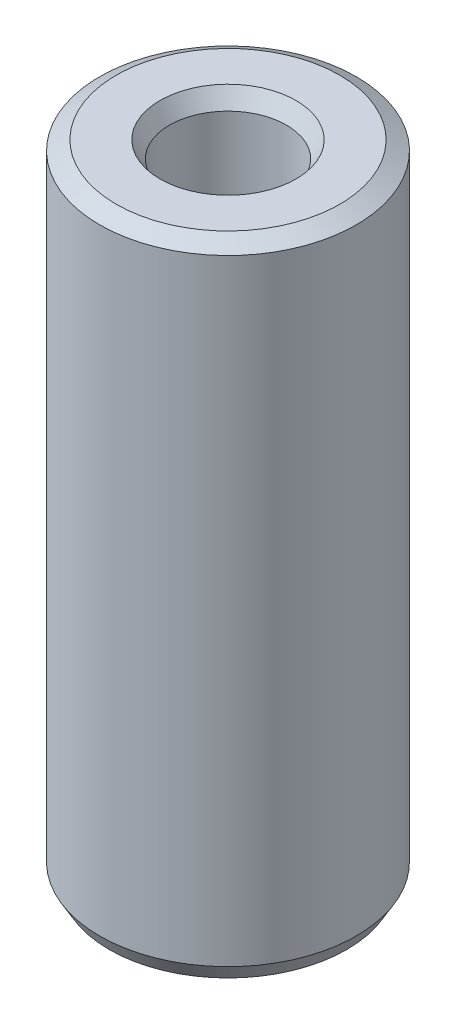
ISO-10303-21;
HEADER;
FILE_DESCRIPTION(('STEP AP214'),'2;1');
FILE_NAME('part.step','',(''),(''),'','','');
FILE_SCHEMA(('AUTOMOTIVE_DESIGN { 1 0 10303 214 1 1 1 1 }'));
ENDSEC;
DATA;
#1=APPLICATION_CONTEXT('core data for automotive mechanical design processes');
#2=APPLICATION_PROTOCOL_DEFINITION('international standard','automotive_design',2000,#1);
#3=PRODUCT_CONTEXT('',#1,'mechanical');
#4=PRODUCT('Part','Part','',(#3));
#5=PRODUCT_RELATED_PRODUCT_CATEGORY('part','',(#4));
#6=PRODUCT_DEFINITION_FORMATION('','',#4);
#7=PRODUCT_DEFINITION_CONTEXT('part definition',#1,'design');
#8=PRODUCT_DEFINITION('design','',#6,#7);
#9=PRODUCT_DEFINITION_SHAPE('','',#8);
#10=(LENGTH_UNIT() NAMED_UNIT(*) SI_UNIT(.MILLI.,.METRE.));
#11=(NAMED_UNIT(*) PLANE_ANGLE_UNIT() SI_UNIT($,.RADIAN.));
#12=(NAMED_UNIT(*) SI_UNIT($,.STERADIAN.) SOLID_ANGLE_UNIT());
#13=UNCERTAINTY_MEASURE_WITH_UNIT(LENGTH_MEASURE(1.E-05),#10,'distance_accuracy_value','');
#14=(GEOMETRIC_REPRESENTATION_CONTEXT(3) GLOBAL_UNCERTAINTY_ASSIGNED_CONTEXT((#13)) GLOBAL_UNIT_ASSIGNED_CONTEXT((#10,
#11,#12)) REPRESENTATION_CONTEXT('',''));
#15=CARTESIAN_POINT('',(0.,0.,0.));
#16=DIRECTION('',(0.,0.,1.));
#17=DIRECTION('',(1.,0.,0.));
#18=AXIS2_PLACEMENT_3D('',#15,#16,#17);
#19=CARTESIAN_POINT('',(0.,150.065307436167,0.));
#20=DIRECTION('',(0.,-1.,0.));
#21=DIRECTION('',(0.,0.,-1.));
#22=AXIS2_PLACEMENT_3D('',#19,#20,#21);
#23=CYLINDRICAL_SURFACE('',#22,30.);
#24=CARTESIAN_POINT('',(0.,3.86641381669273,0.));
#25=DIRECTION('',(0.,1.,0.));
#26=DIRECTION('',(0.,0.,1.));
#27=AXIS2_PLACEMENT_3D('',#24,#25,#26);
#28=CIRCLE('',#27,30.);
#29=CARTESIAN_POINT('',(0.,3.86641381669273,30.));
#30=VERTEX_POINT('',#29);
#31=EDGE_CURVE('E10',#30,#30,#28,.T.);
#32=ORIENTED_EDGE('',*,*,#31,.T.);
#33=EDGE_LOOP('',(#32));
#34=FACE_BOUND('',#33,.T.);
#35=CARTESIAN_POINT('',(0.,147.833032378301,0.));
#36=DIRECTION('',(0.,1.,0.));
#37=DIRECTION('',(0.,0.,1.));
#38=AXIS2_PLACEMENT_3D('',#35,#36,#37);
#39=CIRCLE('',#38,30.);
#40=CARTESIAN_POINT('',(0.,147.833032378301,30.));
#41=VERTEX_POINT('',#40);
#42=EDGE_CURVE('E50',#41,#41,#39,.F.);
#43=ORIENTED_EDGE('',*,*,#42,.T.);
#44=EDGE_LOOP('',(#43));
#45=FACE_BOUND('',#44,.T.);
#46=ADVANCED_FACE('F39',(#34,#45),#23,.T.);
#47=CARTESIAN_POINT('',(0.,150.065307436167,0.));
#48=DIRECTION('',(0.,1.,0.));
#49=DIRECTION('',(0.,0.,1.));
#50=AXIS2_PLACEMENT_3D('',#47,#48,#49);
#51=PLANE('',#50);
#52=CARTESIAN_POINT('',(0.,150.065307436167,0.));
#53=DIRECTION('',(0.,1.,0.));
#54=DIRECTION('',(0.,0.,1.));
#55=AXIS2_PLACEMENT_3D('',#52,#53,#54);
#56=CIRCLE('',#55,15.9015084205418);
#57=CARTESIAN_POINT('',(0.,150.065307436167,15.9015084205418));
#58=VERTEX_POINT('',#57);
#59=EDGE_CURVE('E58',#58,#58,#56,.F.);
#60=ORIENTED_EDGE('',*,*,#59,.T.);
#61=EDGE_LOOP('',(#60));
#62=FACE_BOUND('',#61,.T.);
#63=CARTESIAN_POINT('',(0.,150.065307436167,0.));
#64=DIRECTION('',(0.,1.,0.));
#65=DIRECTION('',(0.,0.,1.));
#66=AXIS2_PLACEMENT_3D('',#63,#64,#65);
#67=CIRCLE('',#66,26.1335861833073);
#68=CARTESIAN_POINT('',(0.,150.065307436167,26.1335861833073));
#69=VERTEX_POINT('',#68);
#70=EDGE_CURVE('E61',#69,#69,#67,.T.);
#71=ORIENTED_EDGE('',*,*,#70,.T.);
#72=EDGE_LOOP('',(#71));
#73=FACE_BOUND('',#72,.T.);
#74=ADVANCED_FACE('F88',(#62,#73),#51,.T.);
#75=CARTESIAN_POINT('',(0.,0.,0.));
#76=DIRECTION('',(0.,1.,0.));
#77=DIRECTION('',(0.,0.,1.));
#78=AXIS2_PLACEMENT_3D('',#75,#76,#77);
#79=PLANE('',#78);
#80=CARTESIAN_POINT('',(0.,0.,0.));
#81=DIRECTION('',(0.,1.,0.));
#82=DIRECTION('',(0.,0.,1.));
#83=AXIS2_PLACEMENT_3D('',#80,#81,#82);
#84=CIRCLE('',#83,17.5356471793684);
#85=CARTESIAN_POINT('',(0.,0.,17.5356471793684));
#86=VERTEX_POINT('',#85);
#87=EDGE_CURVE('E51',#86,#86,#84,.T.);
#88=ORIENTED_EDGE('',*,*,#87,.T.);
#89=EDGE_LOOP('',(#88));
#90=FACE_BOUND('',#89,.T.);
#91=CARTESIAN_POINT('',(0.,0.,0.));
#92=DIRECTION('',(0.,1.,0.));
#93=DIRECTION('',(0.,0.,1.));
#94=AXIS2_PLACEMENT_3D('',#91,#92,#93);
#95=CIRCLE('',#94,27.7677249421339);
#96=CARTESIAN_POINT('',(0.,0.,27.7677249421339));
#97=VERTEX_POINT('',#96);
#98=EDGE_CURVE('E54',#97,#97,#95,.F.);
#99=ORIENTED_EDGE('',*,*,#98,.T.);
#100=EDGE_LOOP('',(#99));
#101=FACE_BOUND('',#100,.T.);
#102=ADVANCED_FACE('F83',(#90,#101),#79,.F.);
#103=CARTESIAN_POINT('',(0.,150.065307436167,0.));
#104=DIRECTION('',(0.,-1.,0.));
#105=DIRECTION('',(0.,0.,-1.));
#106=AXIS2_PLACEMENT_3D('',#103,#104,#105);
#107=CYLINDRICAL_SURFACE('',#106,13.6692333626757);
#108=CARTESIAN_POINT('',(0.,146.198893619474,0.));
#109=DIRECTION('',(0.,1.,0.));
#110=DIRECTION('',(0.,0.,1.));
#111=AXIS2_PLACEMENT_3D('',#108,#109,#110);
#112=CIRCLE('',#111,13.6692333626757);
#113=CARTESIAN_POINT('',(0.,146.198893619474,13.6692333626757));
#114=VERTEX_POINT('',#113);
#115=EDGE_CURVE('E67',#114,#114,#112,.T.);
#116=ORIENTED_EDGE('',*,*,#115,.T.);
#117=EDGE_LOOP('',(#116));
#118=FACE_BOUND('',#117,.T.);
#119=CARTESIAN_POINT('',(0.,2.23227505786605,0.));
#120=DIRECTION('',(0.,1.,0.));
#121=DIRECTION('',(0.,0.,1.));
#122=AXIS2_PLACEMENT_3D('',#119,#120,#121);
#123=CIRCLE('',#122,13.6692333626757);
#124=CARTESIAN_POINT('',(0.,2.23227505786605,13.6692333626757));
#125=VERTEX_POINT('',#124);
#126=EDGE_CURVE('E69',#125,#125,#123,.F.);
#127=ORIENTED_EDGE('',*,*,#126,.T.);
#128=EDGE_LOOP('',(#127));
#129=FACE_BOUND('',#128,.T.);
#130=ADVANCED_FACE('F71',(#118,#129),#107,.F.);
#131=CARTESIAN_POINT('',(0.,146.198893619474,0.));
#132=DIRECTION('',(0.,1.,0.));
#133=DIRECTION('',(0.,0.,1.));
#134=AXIS2_PLACEMENT_3D('',#131,#132,#133);
#135=CONICAL_SURFACE('',#134,13.6692333626757,0.523598775598302);
#136=ORIENTED_EDGE('',*,*,#59,.F.);
#137=EDGE_LOOP('',(#136));
#138=FACE_BOUND('',#137,.T.);
#139=ORIENTED_EDGE('',*,*,#115,.F.);
#140=EDGE_LOOP('',(#139));
#141=FACE_BOUND('',#140,.T.);
#142=ADVANCED_FACE('F77',(#138,#141),#135,.F.);
#143=CARTESIAN_POINT('',(0.,0.,0.));
#144=DIRECTION('',(0.,-1.,0.));
#145=DIRECTION('',(0.,0.,-1.));
#146=AXIS2_PLACEMENT_3D('',#143,#144,#145);
#147=CONICAL_SURFACE('',#146,17.5356471793684,1.04719755119659);
#148=ORIENTED_EDGE('',*,*,#126,.F.);
#149=EDGE_LOOP('',(#148));
#150=FACE_BOUND('',#149,.T.);
#151=ORIENTED_EDGE('',*,*,#87,.F.);
#152=EDGE_LOOP('',(#151));
#153=FACE_BOUND('',#152,.T.);
#154=ADVANCED_FACE('F73',(#150,#153),#147,.F.);
#155=CARTESIAN_POINT('',(0.,3.86641381669273,0.));
#156=DIRECTION('',(0.,1.,0.));
#157=DIRECTION('',(0.,0.,1.));
#158=AXIS2_PLACEMENT_3D('',#155,#156,#157);
#159=CONICAL_SURFACE('',#158,30.,0.523598775598303);
#160=ORIENTED_EDGE('',*,*,#98,.F.);
#161=EDGE_LOOP('',(#160));
#162=FACE_BOUND('',#161,.T.);
#163=ORIENTED_EDGE('',*,*,#31,.F.);
#164=EDGE_LOOP('',(#163));
#165=FACE_BOUND('',#164,.T.);
#166=ADVANCED_FACE('F76',(#162,#165),#159,.T.);
#167=CARTESIAN_POINT('',(0.,150.065307436167,0.));
#168=DIRECTION('',(0.,-1.,0.));
#169=DIRECTION('',(0.,0.,-1.));
#170=AXIS2_PLACEMENT_3D('',#167,#168,#169);
#171=CONICAL_SURFACE('',#170,26.1335861833073,1.04719755119659);
#172=ORIENTED_EDGE('',*,*,#42,.F.);
#173=EDGE_LOOP('',(#172));
#174=FACE_BOUND('',#173,.T.);
#175=ORIENTED_EDGE('',*,*,#70,.F.);
#176=EDGE_LOOP('',(#175));
#177=FACE_BOUND('',#176,.T.);
#178=ADVANCED_FACE('F45',(#174,#177),#171,.T.);
#179=CLOSED_SHELL('',(#46,#74,#102,#130,#142,#154,#166,#178));
#180=MANIFOLD_SOLID_BREP('B2',#179);
#181=ADVANCED_BREP_SHAPE_REPRESENTATION('',(#18,#180),#14);
#182=SHAPE_DEFINITION_REPRESENTATION(#9,#181);
ENDSEC;
END-ISO-10303-21;
